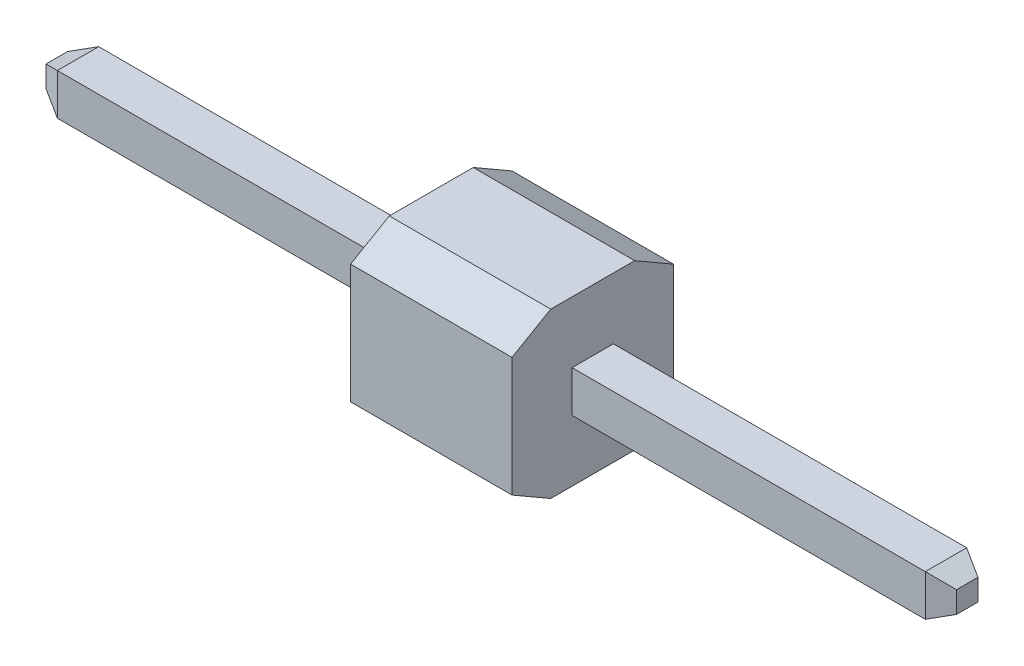
ISO-10303-21;
HEADER;
FILE_DESCRIPTION(('STEP AP214'),'2;1');
FILE_NAME('part.step','',(''),(''),'','','');
FILE_SCHEMA(('AUTOMOTIVE_DESIGN { 1 0 10303 214 1 1 1 1 }'));
ENDSEC;
DATA;
#1=APPLICATION_CONTEXT('core data for automotive mechanical design processes');
#2=APPLICATION_PROTOCOL_DEFINITION('international standard','automotive_design',2000,#1);
#3=PRODUCT_CONTEXT('',#1,'mechanical');
#4=PRODUCT('Part','Part','',(#3));
#5=PRODUCT_RELATED_PRODUCT_CATEGORY('part','',(#4));
#6=PRODUCT_DEFINITION_FORMATION('','',#4);
#7=PRODUCT_DEFINITION_CONTEXT('part definition',#1,'design');
#8=PRODUCT_DEFINITION('design','',#6,#7);
#9=PRODUCT_DEFINITION_SHAPE('','',#8);
#10=(LENGTH_UNIT() NAMED_UNIT(*) SI_UNIT(.MILLI.,.METRE.));
#11=(NAMED_UNIT(*) PLANE_ANGLE_UNIT() SI_UNIT($,.RADIAN.));
#12=(NAMED_UNIT(*) SI_UNIT($,.STERADIAN.) SOLID_ANGLE_UNIT());
#13=UNCERTAINTY_MEASURE_WITH_UNIT(LENGTH_MEASURE(1.E-05),#10,'distance_accuracy_value','');
#14=(GEOMETRIC_REPRESENTATION_CONTEXT(3) GLOBAL_UNCERTAINTY_ASSIGNED_CONTEXT((#13)) GLOBAL_UNIT_ASSIGNED_CONTEXT((#10,
#11,#12)) REPRESENTATION_CONTEXT('',''));
#15=CARTESIAN_POINT('',(0.,0.,0.));
#16=DIRECTION('',(0.,0.,1.));
#17=DIRECTION('',(1.,0.,0.));
#18=AXIS2_PLACEMENT_3D('',#15,#16,#17);
#19=CARTESIAN_POINT('',(5.42107538965371,-10.4771282629139,0.629998634255617));
#20=DIRECTION('',(1.,4.37113882867379E-08,-4.37113882867379E-08));
#21=DIRECTION('',(-4.37113882867379E-08,1.,0.));
#22=AXIS2_PLACEMENT_3D('',#19,#20,#21);
#23=PLANE('',#22);
#24=DIRECTION('',(1.59994777304463E-08,0.50000000000019,0.866025403784329));
#25=VECTOR('',#24,1.);
#26=CARTESIAN_POINT('',(5.4210752666678,-9.23353842442392,-0.940001365744382));
#27=LINE('',#26,#25);
#28=CARTESIAN_POINT('',(5.4210752666678,-9.23353842442392,-0.940001365744382));
#29=VERTEX_POINT('',#28);
#30=CARTESIAN_POINT('',(5.42107527775256,-8.88712826291392,-0.340001365744383));
#31=VERTEX_POINT('',#30);
#32=EDGE_CURVE('E11',#29,#31,#27,.T.);
#33=ORIENTED_EDGE('',*,*,#32,.T.);
#34=DIRECTION('',(4.37113886966664E-08,0.,0.999999999999999));
#35=VECTOR('',#34,1.);
#36=CARTESIAN_POINT('',(5.42107527775256,-8.88712826291392,-0.340001365744383));
#37=LINE('',#36,#35);
#38=CARTESIAN_POINT('',(5.42107533457736,-8.88712826291391,0.959998634255618));
#39=VERTEX_POINT('',#38);
#40=EDGE_CURVE('E304',#31,#39,#37,.T.);
#41=ORIENTED_EDGE('',*,*,#40,.T.);
#42=DIRECTION('',(5.97108668825761E-08,-0.500000000000186,0.86602540378433));
#43=VECTOR('',#42,1.);
#44=CARTESIAN_POINT('',(5.42107533457736,-8.88712826291391,0.959998634255618));
#45=LINE('',#44,#43);
#46=CARTESIAN_POINT('',(5.42107537594627,-9.23353842442391,1.55999863425562));
#47=VERTEX_POINT('',#46);
#48=EDGE_CURVE('E296',#39,#47,#45,.T.);
#49=ORIENTED_EDGE('',*,*,#48,.T.);
#50=DIRECTION('',(4.37113884815545E-08,-0.999999999999999,0.));
#51=VECTOR('',#50,1.);
#52=CARTESIAN_POINT('',(5.42107537594627,-9.23353842442391,1.55999863425562));
#53=LINE('',#52,#51);
#54=CARTESIAN_POINT('',(5.42107545668905,-11.0807181013939,1.55999863425562));
#55=VERTEX_POINT('',#54);
#56=EDGE_CURVE('E281',#47,#55,#53,.T.);
#57=ORIENTED_EDGE('',*,*,#56,.T.);
#58=DIRECTION('',(1.59994802942811E-08,0.500000000000192,0.866025403784328));
#59=VECTOR('',#58,1.);
#60=CARTESIAN_POINT('',(5.42107544560429,-11.4271282629139,0.959998634255618));
#61=LINE('',#60,#59);
#62=CARTESIAN_POINT('',(5.42107544560429,-11.4271282629139,0.959998634255618));
#63=VERTEX_POINT('',#62);
#64=EDGE_CURVE('E265',#63,#55,#61,.T.);
#65=ORIENTED_EDGE('',*,*,#64,.F.);
#66=DIRECTION('',(4.37113880134522E-08,0.,0.999999999999999));
#67=VECTOR('',#66,1.);
#68=CARTESIAN_POINT('',(5.42107538877949,-11.4271282629139,-0.340001365744383));
#69=LINE('',#68,#67);
#70=CARTESIAN_POINT('',(5.42107538877949,-11.4271282629139,-0.340001365744383));
#71=VERTEX_POINT('',#70);
#72=EDGE_CURVE('E248',#71,#63,#69,.T.);
#73=ORIENTED_EDGE('',*,*,#72,.F.);
#74=DIRECTION('',(5.97108656001701E-08,-0.500000000000187,0.866025403784328));
#75=VECTOR('',#74,1.);
#76=CARTESIAN_POINT('',(5.42107534741058,-11.0807181013939,-0.940001365744382));
#77=LINE('',#76,#75);
#78=CARTESIAN_POINT('',(5.42107534741058,-11.0807181013939,-0.940001365744382));
#79=VERTEX_POINT('',#78);
#80=EDGE_CURVE('E242',#79,#71,#77,.T.);
#81=ORIENTED_EDGE('',*,*,#80,.F.);
#82=DIRECTION('',(4.37113884815545E-08,-0.999999999999999,0.));
#83=VECTOR('',#82,1.);
#84=CARTESIAN_POINT('',(5.4210752666678,-9.23353842442392,-0.940001365744382));
#85=LINE('',#84,#83);
#86=EDGE_CURVE('E236',#29,#79,#85,.T.);
#87=ORIENTED_EDGE('',*,*,#86,.F.);
#88=EDGE_LOOP('',(#33,#41,#49,#57,#65,#73,#81,#87));
#89=FACE_BOUND('',#88,.T.);
#90=DIRECTION('',(-4.37113872875372E-08,0.,-0.999999999999999));
#91=VECTOR('',#90,1.);
#92=CARTESIAN_POINT('',(5.42107536167842,-9.83712826291391,0.629998634255617));
#93=LINE('',#92,#91);
#94=CARTESIAN_POINT('',(5.42107536167842,-9.83712826291391,0.629998634255617));
#95=VERTEX_POINT('',#94);
#96=CARTESIAN_POINT('',(5.42107533370314,-9.83712826291391,-0.0100013657443826));
#97=VERTEX_POINT('',#96);
#98=EDGE_CURVE('E302',#95,#97,#93,.T.);
#99=ORIENTED_EDGE('',*,*,#98,.T.);
#100=DIRECTION('',(-4.37113872875371E-08,0.999999999999999,0.));
#101=VECTOR('',#100,1.);
#102=CARTESIAN_POINT('',(5.42107536167842,-10.4771282629139,-0.0100013657443826));
#103=LINE('',#102,#101);
#104=CARTESIAN_POINT('',(5.42107536167842,-10.4771282629139,-0.0100013657443826));
#105=VERTEX_POINT('',#104);
#106=EDGE_CURVE('E293',#105,#97,#103,.T.);
#107=ORIENTED_EDGE('',*,*,#106,.F.);
#108=DIRECTION('',(-4.37113900630947E-08,0.,-0.999999999999999));
#109=VECTOR('',#108,1.);
#110=CARTESIAN_POINT('',(5.42107538965371,-10.4771282629139,0.629998634255617));
#111=LINE('',#110,#109);
#112=CARTESIAN_POINT('',(5.42107538965371,-10.4771282629139,0.629998634255617));
#113=VERTEX_POINT('',#112);
#114=EDGE_CURVE('E278',#113,#105,#111,.T.);
#115=ORIENTED_EDGE('',*,*,#114,.F.);
#116=DIRECTION('',(-4.37113900630947E-08,0.999999999999999,0.));
#117=VECTOR('',#116,1.);
#118=CARTESIAN_POINT('',(5.42107538965371,-10.4771282629139,0.629998634255617));
#119=LINE('',#118,#117);
#120=EDGE_CURVE('E263',#113,#95,#119,.T.);
#121=ORIENTED_EDGE('',*,*,#120,.T.);
#122=EDGE_LOOP('',(#99,#107,#115,#121));
#123=FACE_BOUND('',#122,.T.);
#124=ADVANCED_FACE('F17',(#89,#123),#23,.T.);
#125=CARTESIAN_POINT('',(2.92107538965371,-10.4771283721924,0.629998743534088));
#126=DIRECTION('',(1.,4.37113882867379E-08,-4.37113882867379E-08));
#127=DIRECTION('',(-4.37113882867379E-08,1.,0.));
#128=AXIS2_PLACEMENT_3D('',#125,#126,#127);
#129=PLANE('',#128);
#130=DIRECTION('',(1.59994783714339E-08,0.50000000000019,0.866025403784329));
#131=VECTOR('',#130,1.);
#132=CARTESIAN_POINT('',(2.9210752666678,-9.23353853370239,-0.940001256465912));
#133=LINE('',#132,#131);
#134=CARTESIAN_POINT('',(2.9210752666678,-9.23353853370239,-0.940001256465912));
#135=VERTEX_POINT('',#134);
#136=CARTESIAN_POINT('',(2.92107527775256,-8.88712837219239,-0.340001256465912));
#137=VERTEX_POINT('',#136);
#138=EDGE_CURVE('E24',#135,#137,#133,.T.);
#139=ORIENTED_EDGE('',*,*,#138,.F.);
#140=DIRECTION('',(4.37113882411397E-08,-0.999999999999999,0.));
#141=VECTOR('',#140,1.);
#142=CARTESIAN_POINT('',(2.9210752666678,-9.23353853370239,-0.940001256465912));
#143=LINE('',#142,#141);
#144=CARTESIAN_POINT('',(2.92107534741058,-11.0807182106724,-0.940001256465912));
#145=VERTEX_POINT('',#144);
#146=EDGE_CURVE('E300',#135,#145,#143,.T.);
#147=ORIENTED_EDGE('',*,*,#146,.T.);
#148=DIRECTION('',(5.97108668821452E-08,-0.500000000000187,0.866025403784328));
#149=VECTOR('',#148,1.);
#150=CARTESIAN_POINT('',(2.92107534741058,-11.0807182106724,-0.940001256465912));
#151=LINE('',#150,#149);
#152=CARTESIAN_POINT('',(2.92107538877949,-11.4271283721924,-0.340001256465912));
#153=VERTEX_POINT('',#152);
#154=EDGE_CURVE('E286',#145,#153,#151,.T.);
#155=ORIENTED_EDGE('',*,*,#154,.T.);
#156=DIRECTION('',(4.37113880134522E-08,0.,0.999999999999999));
#157=VECTOR('',#156,1.);
#158=CARTESIAN_POINT('',(2.92107538877949,-11.4271283721924,-0.340001256465912));
#159=LINE('',#158,#157);
#160=CARTESIAN_POINT('',(2.92107544560429,-11.4271283721924,0.959998743534088));
#161=VERTEX_POINT('',#160);
#162=EDGE_CURVE('E271',#153,#161,#159,.T.);
#163=ORIENTED_EDGE('',*,*,#162,.T.);
#164=DIRECTION('',(1.5999479012306E-08,0.500000000000192,0.866025403784328));
#165=VECTOR('',#164,1.);
#166=CARTESIAN_POINT('',(2.92107544560429,-11.4271283721924,0.959998743534088));
#167=LINE('',#166,#165);
#168=CARTESIAN_POINT('',(2.92107545668905,-11.0807182106724,1.55999874353409));
#169=VERTEX_POINT('',#168);
#170=EDGE_CURVE('E253',#161,#169,#167,.T.);
#171=ORIENTED_EDGE('',*,*,#170,.T.);
#172=DIRECTION('',(4.37113882411397E-08,-0.999999999999999,0.));
#173=VECTOR('',#172,1.);
#174=CARTESIAN_POINT('',(2.92107537594627,-9.23353853370238,1.55999874353409));
#175=LINE('',#174,#173);
#176=CARTESIAN_POINT('',(2.92107537594627,-9.23353853370238,1.55999874353409));
#177=VERTEX_POINT('',#176);
#178=EDGE_CURVE('E261',#177,#169,#175,.T.);
#179=ORIENTED_EDGE('',*,*,#178,.F.);
#180=DIRECTION('',(5.97108668825761E-08,-0.500000000000186,0.86602540378433));
#181=VECTOR('',#180,1.);
#182=CARTESIAN_POINT('',(2.92107533457736,-8.88712837219238,0.959998743534088));
#183=LINE('',#182,#181);
#184=CARTESIAN_POINT('',(2.92107533457736,-8.88712837219238,0.959998743534088));
#185=VERTEX_POINT('',#184);
#186=EDGE_CURVE('E276',#185,#177,#183,.T.);
#187=ORIENTED_EDGE('',*,*,#186,.F.);
#188=DIRECTION('',(4.37113883550593E-08,0.,0.999999999999999));
#189=VECTOR('',#188,1.);
#190=CARTESIAN_POINT('',(2.92107527775256,-8.88712837219239,-0.340001256465912));
#191=LINE('',#190,#189);
#192=EDGE_CURVE('E291',#137,#185,#191,.T.);
#193=ORIENTED_EDGE('',*,*,#192,.F.);
#194=EDGE_LOOP('',(#139,#147,#155,#163,#171,#179,#187,#193));
#195=FACE_BOUND('',#194,.T.);
#196=DIRECTION('',(-4.37113879814265E-08,0.999999999999999,0.));
#197=VECTOR('',#196,1.);
#198=CARTESIAN_POINT('',(2.92107536167842,-10.4771283721924,-0.0100012564659119));
#199=LINE('',#198,#197);
#200=CARTESIAN_POINT('',(2.92107536167842,-10.4771283721924,-0.0100012564659119));
#201=VERTEX_POINT('',#200);
#202=CARTESIAN_POINT('',(2.92107533370314,-9.83712837219238,-0.0100012564659119));
#203=VERTEX_POINT('',#202);
#204=EDGE_CURVE('E298',#201,#203,#199,.T.);
#205=ORIENTED_EDGE('',*,*,#204,.T.);
#206=DIRECTION('',(-4.37113879814266E-08,0.,-0.999999999999999));
#207=VECTOR('',#206,1.);
#208=CARTESIAN_POINT('',(2.92107536167842,-9.83712837219238,0.629998743534088));
#209=LINE('',#208,#207);
#210=CARTESIAN_POINT('',(2.92107536167842,-9.83712837219238,0.629998743534088));
#211=VERTEX_POINT('',#210);
#212=EDGE_CURVE('E283',#211,#203,#209,.T.);
#213=ORIENTED_EDGE('',*,*,#212,.F.);
#214=DIRECTION('',(-4.37113886753159E-08,0.999999999999999,0.));
#215=VECTOR('',#214,1.);
#216=CARTESIAN_POINT('',(2.92107538965371,-10.4771283721924,0.629998743534088));
#217=LINE('',#216,#215);
#218=CARTESIAN_POINT('',(2.92107538965371,-10.4771283721924,0.629998743534088));
#219=VERTEX_POINT('',#218);
#220=EDGE_CURVE('E268',#219,#211,#217,.T.);
#221=ORIENTED_EDGE('',*,*,#220,.F.);
#222=DIRECTION('',(-4.37113886753159E-08,0.,-0.999999999999999));
#223=VECTOR('',#222,1.);
#224=CARTESIAN_POINT('',(2.92107538965371,-10.4771283721924,0.629998743534088));
#225=LINE('',#224,#223);
#226=EDGE_CURVE('E251',#219,#201,#225,.T.);
#227=ORIENTED_EDGE('',*,*,#226,.T.);
#228=EDGE_LOOP('',(#205,#213,#221,#227));
#229=FACE_BOUND('',#228,.T.);
#230=ADVANCED_FACE('F314',(#195,#229),#129,.F.);
#231=CARTESIAN_POINT('',(5.4210752666678,-9.23353842442392,-0.940001365744382));
#232=DIRECTION('',(5.97108668343731E-08,-0.866025403784328,0.50000000000019));
#233=DIRECTION('',(-1.59994785476185E-08,-0.500000000000192,-0.866025403784329));
#234=AXIS2_PLACEMENT_3D('',#231,#232,#233);
#235=PLANE('',#234);
#236=ORIENTED_EDGE('',*,*,#138,.T.);
#237=DIRECTION('',(-0.999999999999998,-4.37113868656524E-08,4.37113883755557E-08));
#238=VECTOR('',#237,1.);
#239=CARTESIAN_POINT('',(5.42107527775256,-8.88712826291392,-0.340001365744383));
#240=LINE('',#239,#238);
#241=EDGE_CURVE('E288',#31,#137,#240,.T.);
#242=ORIENTED_EDGE('',*,*,#241,.F.);
#243=ORIENTED_EDGE('',*,*,#32,.F.);
#244=DIRECTION('',(-0.999999999999998,-4.37113897078233E-08,4.37113881091022E-08));
#245=VECTOR('',#244,1.);
#246=CARTESIAN_POINT('',(5.4210752666678,-9.23353842442392,-0.940001365744382));
#247=LINE('',#246,#245);
#248=EDGE_CURVE('E256',#29,#135,#247,.T.);
#249=ORIENTED_EDGE('',*,*,#248,.T.);
#250=EDGE_LOOP('',(#236,#242,#243,#249));
#251=FACE_BOUND('',#250,.T.);
#252=ADVANCED_FACE('F306',(#251),#235,.F.);
#253=CARTESIAN_POINT('',(5.42107527775256,-8.88712826291392,-0.340001365744383));
#254=DIRECTION('',(4.37113882867379E-08,-1.,0.));
#255=DIRECTION('',(1.,4.37113882867379E-08,-4.37113882867379E-08));
#256=AXIS2_PLACEMENT_3D('',#253,#254,#255);
#257=PLANE('',#256);
#258=ORIENTED_EDGE('',*,*,#192,.T.);
#259=DIRECTION('',(-0.999999999999998,-4.37113868656524E-08,4.37113882867378E-08));
#260=VECTOR('',#259,1.);
#261=CARTESIAN_POINT('',(5.42107533457736,-8.88712826291391,0.959998634255618));
#262=LINE('',#261,#260);
#263=EDGE_CURVE('E273',#39,#185,#262,.T.);
#264=ORIENTED_EDGE('',*,*,#263,.F.);
#265=ORIENTED_EDGE('',*,*,#40,.F.);
#266=ORIENTED_EDGE('',*,*,#241,.T.);
#267=EDGE_LOOP('',(#258,#264,#265,#266));
#268=FACE_BOUND('',#267,.T.);
#269=ADVANCED_FACE('F311',(#268),#257,.F.);
#270=CARTESIAN_POINT('',(5.42107533457736,-8.88712826291391,0.959998634255618));
#271=DIRECTION('',(1.59994785476185E-08,-0.86602540378433,-0.50000000000019));
#272=DIRECTION('',(-5.97108668343731E-08,0.500000000000188,-0.866025403784329));
#273=AXIS2_PLACEMENT_3D('',#270,#271,#272);
#274=PLANE('',#273);
#275=ORIENTED_EDGE('',*,*,#186,.T.);
#276=DIRECTION('',(-0.999999999999998,-4.37113897078233E-08,4.37113882867378E-08));
#277=VECTOR('',#276,1.);
#278=CARTESIAN_POINT('',(5.42107537594627,-9.23353842442391,1.55999863425562));
#279=LINE('',#278,#277);
#280=EDGE_CURVE('E258',#47,#177,#279,.T.);
#281=ORIENTED_EDGE('',*,*,#280,.F.);
#282=ORIENTED_EDGE('',*,*,#48,.F.);
#283=ORIENTED_EDGE('',*,*,#263,.T.);
#284=EDGE_LOOP('',(#275,#281,#282,#283));
#285=FACE_BOUND('',#284,.T.);
#286=ADVANCED_FACE('F319',(#285),#274,.F.);
#287=CARTESIAN_POINT('',(5.42107537594627,-9.23353842442391,1.55999863425562));
#288=DIRECTION('',(-4.37113882867379E-08,0.,-1.));
#289=DIRECTION('',(-1.,-4.37113882867379E-08,4.37113882867379E-08));
#290=AXIS2_PLACEMENT_3D('',#287,#288,#289);
#291=PLANE('',#290);
#292=ORIENTED_EDGE('',*,*,#178,.T.);
#293=DIRECTION('',(-0.999999999999998,-4.37113897078233E-08,4.37113882867378E-08));
#294=VECTOR('',#293,1.);
#295=CARTESIAN_POINT('',(5.42107545668905,-11.0807181013939,1.55999863425562));
#296=LINE('',#295,#294);
#297=EDGE_CURVE('E245',#55,#169,#296,.T.);
#298=ORIENTED_EDGE('',*,*,#297,.F.);
#299=ORIENTED_EDGE('',*,*,#56,.F.);
#300=ORIENTED_EDGE('',*,*,#280,.T.);
#301=EDGE_LOOP('',(#292,#298,#299,#300));
#302=FACE_BOUND('',#301,.T.);
#303=ADVANCED_FACE('F326',(#302),#291,.F.);
#304=CARTESIAN_POINT('',(5.42107544560429,-11.4271282629139,0.959998634255618));
#305=DIRECTION('',(5.97108668343731E-08,-0.866025403784328,0.50000000000019));
#306=DIRECTION('',(-1.59994785476185E-08,-0.500000000000192,-0.866025403784329));
#307=AXIS2_PLACEMENT_3D('',#304,#305,#306);
#308=PLANE('',#307);
#309=ORIENTED_EDGE('',*,*,#170,.F.);
#310=DIRECTION('',(-0.999999999999998,-4.37113897078233E-08,4.37113882867378E-08));
#311=VECTOR('',#310,1.);
#312=CARTESIAN_POINT('',(5.42107544560429,-11.4271282629139,0.959998634255618));
#313=LINE('',#312,#311);
#314=EDGE_CURVE('E239',#63,#161,#313,.T.);
#315=ORIENTED_EDGE('',*,*,#314,.F.);
#316=ORIENTED_EDGE('',*,*,#64,.T.);
#317=ORIENTED_EDGE('',*,*,#297,.T.);
#318=EDGE_LOOP('',(#309,#315,#316,#317));
#319=FACE_BOUND('',#318,.T.);
#320=ADVANCED_FACE('F329',(#319),#308,.T.);
#321=CARTESIAN_POINT('',(5.42107538877949,-11.4271282629139,-0.340001365744383));
#322=DIRECTION('',(4.37113882867379E-08,-1.,0.));
#323=DIRECTION('',(1.,4.37113882867379E-08,-4.37113882867379E-08));
#324=AXIS2_PLACEMENT_3D('',#321,#322,#323);
#325=PLANE('',#324);
#326=ORIENTED_EDGE('',*,*,#162,.F.);
#327=DIRECTION('',(-0.999999999999998,-4.37113897078233E-08,4.37113883755557E-08));
#328=VECTOR('',#327,1.);
#329=CARTESIAN_POINT('',(5.42107538877949,-11.4271282629139,-0.340001365744383));
#330=LINE('',#329,#328);
#331=EDGE_CURVE('E233',#71,#153,#330,.T.);
#332=ORIENTED_EDGE('',*,*,#331,.F.);
#333=ORIENTED_EDGE('',*,*,#72,.T.);
#334=ORIENTED_EDGE('',*,*,#314,.T.);
#335=EDGE_LOOP('',(#326,#332,#333,#334));
#336=FACE_BOUND('',#335,.T.);
#337=ADVANCED_FACE('F333',(#336),#325,.T.);
#338=CARTESIAN_POINT('',(5.42107534741058,-11.0807181013939,-0.940001365744382));
#339=DIRECTION('',(1.59994785476185E-08,-0.86602540378433,-0.50000000000019));
#340=DIRECTION('',(-5.97108668343731E-08,0.500000000000188,-0.866025403784329));
#341=AXIS2_PLACEMENT_3D('',#338,#339,#340);
#342=PLANE('',#341);
#343=ORIENTED_EDGE('',*,*,#154,.F.);
#344=DIRECTION('',(-0.999999999999998,-4.37113897078233E-08,4.37113881091021E-08));
#345=VECTOR('',#344,1.);
#346=CARTESIAN_POINT('',(5.42107534741058,-11.0807181013939,-0.940001365744382));
#347=LINE('',#346,#345);
#348=EDGE_CURVE('E230',#79,#145,#347,.T.);
#349=ORIENTED_EDGE('',*,*,#348,.F.);
#350=ORIENTED_EDGE('',*,*,#80,.T.);
#351=ORIENTED_EDGE('',*,*,#331,.T.);
#352=EDGE_LOOP('',(#343,#349,#350,#351));
#353=FACE_BOUND('',#352,.T.);
#354=ADVANCED_FACE('F337',(#353),#342,.T.);
#355=CARTESIAN_POINT('',(5.4210752666678,-9.23353842442392,-0.940001365744382));
#356=DIRECTION('',(-4.37113882867379E-08,0.,-1.));
#357=DIRECTION('',(-4.37113882867379E-08,1.,0.));
#358=AXIS2_PLACEMENT_3D('',#355,#356,#357);
#359=PLANE('',#358);
#360=ORIENTED_EDGE('',*,*,#146,.F.);
#361=ORIENTED_EDGE('',*,*,#248,.F.);
#362=ORIENTED_EDGE('',*,*,#86,.T.);
#363=ORIENTED_EDGE('',*,*,#348,.T.);
#364=EDGE_LOOP('',(#360,#361,#362,#363));
#365=FACE_BOUND('',#364,.T.);
#366=ADVANCED_FACE('F339',(#365),#359,.T.);
#367=CARTESIAN_POINT('',(-2.87892461034629,-10.4771286257184,0.62999899706014));
#368=DIRECTION('',(-1.,-4.37113882867379E-08,4.37113882867379E-08));
#369=DIRECTION('',(4.37113882867379E-08,-1.,0.));
#370=AXIS2_PLACEMENT_3D('',#367,#368,#369);
#371=PLANE('',#370);
#372=DIRECTION('',(4.37113927490808E-08,-0.999999999999999,0.));
#373=VECTOR('',#372,1.);
#374=CARTESIAN_POINT('',(-2.87892465284411,-9.99101015290844,0.14388052425114));
#375=LINE('',#374,#373);
#376=CARTESIAN_POINT('',(-2.87892465284411,-9.99101015290844,0.14388052425114));
#377=VERTEX_POINT('',#376);
#378=CARTESIAN_POINT('',(-2.87892463832158,-10.3232470985184,0.14388052425114));
#379=VERTEX_POINT('',#378);
#380=EDGE_CURVE('E228',#377,#379,#375,.T.);
#381=ORIENTED_EDGE('',*,*,#380,.T.);
#382=DIRECTION('',(4.37113874013716E-08,0.,0.999999999999999));
#383=VECTOR('',#382,1.);
#384=CARTESIAN_POINT('',(-2.87892463832158,-10.3232470985184,0.14388052425114));
#385=LINE('',#384,#383);
#386=CARTESIAN_POINT('',(-2.87892462379904,-10.3232470985184,0.47611746986914));
#387=VERTEX_POINT('',#386);
#388=EDGE_CURVE('E223',#379,#387,#385,.T.);
#389=ORIENTED_EDGE('',*,*,#388,.T.);
#390=DIRECTION('',(-4.37113900757526E-08,0.999999999999999,0.));
#391=VECTOR('',#390,1.);
#392=CARTESIAN_POINT('',(-2.87892462379904,-10.3232470985184,0.47611746986914));
#393=LINE('',#392,#391);
#394=CARTESIAN_POINT('',(-2.87892463832158,-9.99101015290844,0.47611746986914));
#395=VERTEX_POINT('',#394);
#396=EDGE_CURVE('E215',#387,#395,#393,.T.);
#397=ORIENTED_EDGE('',*,*,#396,.T.);
#398=DIRECTION('',(-4.37113847280434E-08,0.,-0.999999999999999));
#399=VECTOR('',#398,1.);
#400=CARTESIAN_POINT('',(-2.87892463832158,-9.99101015290844,0.47611746986914));
#401=LINE('',#400,#399);
#402=EDGE_CURVE('E207',#395,#377,#401,.T.);
#403=ORIENTED_EDGE('',*,*,#402,.T.);
#404=EDGE_LOOP('',(#381,#389,#397,#403));
#405=FACE_BOUND('',#404,.T.);
#406=ADVANCED_FACE('F341',(#405),#371,.T.);
#407=CARTESIAN_POINT('',(-2.87892461034629,-10.4771286257184,0.62999899706014));
#408=DIRECTION('',(4.37113882867379E-08,-1.,0.));
#409=DIRECTION('',(-4.37113882867379E-08,0.,-1.));
#410=AXIS2_PLACEMENT_3D('',#407,#408,#409);
#411=PLANE('',#410);
#412=DIRECTION('',(0.999999999999998,4.37113881958092E-08,-4.37113882769955E-08));
#413=VECTOR('',#412,1.);
#414=CARTESIAN_POINT('',(-2.54892461034629,-10.4771286112937,0.629998982635382));
#415=LINE('',#414,#413);
#416=CARTESIAN_POINT('',(-2.54892461034629,-10.4771286112937,0.629998982635382));
#417=VERTEX_POINT('',#416);
#418=EDGE_CURVE('E225',#417,#219,#415,.T.);
#419=ORIENTED_EDGE('',*,*,#418,.F.);
#420=DIRECTION('',(-4.37113872875372E-08,0.,-0.999999999999999));
#421=VECTOR('',#420,1.);
#422=CARTESIAN_POINT('',(-2.54892461034629,-10.4771286112937,0.629998982635382));
#423=LINE('',#422,#421);
#424=CARTESIAN_POINT('',(-2.54892463832157,-10.4771286112937,-0.010001017364618));
#425=VERTEX_POINT('',#424);
#426=EDGE_CURVE('E217',#417,#425,#423,.T.);
#427=ORIENTED_EDGE('',*,*,#426,.T.);
#428=DIRECTION('',(0.999999999999998,4.37113881958092E-08,-4.37113882161058E-08));
#429=VECTOR('',#428,1.);
#430=CARTESIAN_POINT('',(-2.54892463832157,-10.4771286112937,-0.010001017364618));
#431=LINE('',#430,#429);
#432=EDGE_CURVE('E220',#425,#201,#431,.T.);
#433=ORIENTED_EDGE('',*,*,#432,.T.);
#434=ORIENTED_EDGE('',*,*,#226,.F.);
#435=EDGE_LOOP('',(#419,#427,#433,#434));
#436=FACE_BOUND('',#435,.T.);
#437=ADVANCED_FACE('F348',(#436),#411,.T.);
#438=CARTESIAN_POINT('',(-2.87892463832158,-10.4771286257184,-0.0100010029398598));
#439=DIRECTION('',(-4.37113882867379E-08,0.,-1.));
#440=DIRECTION('',(-1.,-4.37113882867379E-08,4.37113882867379E-08));
#441=AXIS2_PLACEMENT_3D('',#438,#439,#440);
#442=PLANE('',#441);
#443=ORIENTED_EDGE('',*,*,#432,.F.);
#444=DIRECTION('',(-4.37113886753159E-08,0.999999999999999,0.));
#445=VECTOR('',#444,1.);
#446=CARTESIAN_POINT('',(-2.54892463832157,-10.4771286112937,-0.010001017364618));
#447=LINE('',#446,#445);
#448=CARTESIAN_POINT('',(-2.54892466629686,-9.83712861129368,-0.010001017364618));
#449=VERTEX_POINT('',#448);
#450=EDGE_CURVE('E209',#425,#449,#447,.T.);
#451=ORIENTED_EDGE('',*,*,#450,.T.);
#452=DIRECTION('',(0.999999999999998,4.37113907937716E-08,-4.37113882161057E-08));
#453=VECTOR('',#452,1.);
#454=CARTESIAN_POINT('',(-2.54892466629686,-9.83712861129368,-0.010001017364618));
#455=LINE('',#454,#453);
#456=EDGE_CURVE('E212',#449,#203,#455,.T.);
#457=ORIENTED_EDGE('',*,*,#456,.T.);
#458=ORIENTED_EDGE('',*,*,#204,.F.);
#459=EDGE_LOOP('',(#443,#451,#457,#458));
#460=FACE_BOUND('',#459,.T.);
#461=ADVANCED_FACE('F424',(#460),#442,.T.);
#462=CARTESIAN_POINT('',(-2.87892463832158,-9.83712862571844,0.62999899706014));
#463=DIRECTION('',(4.37113882867379E-08,-1.,0.));
#464=DIRECTION('',(-4.37113882867379E-08,0.,-1.));
#465=AXIS2_PLACEMENT_3D('',#462,#463,#464);
#466=PLANE('',#465);
#467=ORIENTED_EDGE('',*,*,#456,.F.);
#468=DIRECTION('',(4.37113900630947E-08,0.,0.999999999999999));
#469=VECTOR('',#468,1.);
#470=CARTESIAN_POINT('',(-2.54892466629686,-9.83712861129368,-0.010001017364618));
#471=LINE('',#470,#469);
#472=CARTESIAN_POINT('',(-2.54892463832157,-9.83712861129368,0.629998982635382));
#473=VERTEX_POINT('',#472);
#474=EDGE_CURVE('E201',#449,#473,#471,.T.);
#475=ORIENTED_EDGE('',*,*,#474,.T.);
#476=DIRECTION('',(0.999999999999998,4.37113907937716E-08,-4.37113882769955E-08));
#477=VECTOR('',#476,1.);
#478=CARTESIAN_POINT('',(-2.54892463832157,-9.83712861129368,0.629998982635382));
#479=LINE('',#478,#477);
#480=EDGE_CURVE('E204',#473,#211,#479,.T.);
#481=ORIENTED_EDGE('',*,*,#480,.T.);
#482=ORIENTED_EDGE('',*,*,#212,.T.);
#483=EDGE_LOOP('',(#467,#475,#481,#482));
#484=FACE_BOUND('',#483,.T.);
#485=ADVANCED_FACE('F421',(#484),#466,.F.);
#486=CARTESIAN_POINT('',(-2.87892461034629,-10.4771286257184,0.62999899706014));
#487=DIRECTION('',(-4.37113882867379E-08,0.,-1.));
#488=DIRECTION('',(-1.,-4.37113882867379E-08,4.37113882867379E-08));
#489=AXIS2_PLACEMENT_3D('',#486,#487,#488);
#490=PLANE('',#489);
#491=ORIENTED_EDGE('',*,*,#480,.F.);
#492=DIRECTION('',(4.37113858997586E-08,-0.999999999999999,0.));
#493=VECTOR('',#492,1.);
#494=CARTESIAN_POINT('',(-2.54892463832157,-9.83712861129368,0.629998982635382));
#495=LINE('',#494,#493);
#496=EDGE_CURVE('E196',#473,#417,#495,.T.);
#497=ORIENTED_EDGE('',*,*,#496,.T.);
#498=ORIENTED_EDGE('',*,*,#418,.T.);
#499=ORIENTED_EDGE('',*,*,#220,.T.);
#500=EDGE_LOOP('',(#491,#497,#498,#499));
#501=FACE_BOUND('',#500,.T.);
#502=ADVANCED_FACE('F376',(#501),#490,.F.);
#503=CARTESIAN_POINT('',(-2.87892461034629,-10.4771286257184,0.62999899706014));
#504=DIRECTION('',(-4.37113882867379E-08,0.,-1.));
#505=DIRECTION('',(-1.,-4.37113882867379E-08,4.37113882867379E-08));
#506=AXIS2_PLACEMENT_3D('',#503,#504,#505);
#507=PLANE('',#506);
#508=DIRECTION('',(0.999999999999998,4.37113829998842E-08,-4.37113882769955E-08));
#509=VECTOR('',#508,1.);
#510=CARTESIAN_POINT('',(5.42107538965371,-10.4771282629139,0.629998634255617));
#511=LINE('',#510,#509);
#512=CARTESIAN_POINT('',(10.8910753896537,-10.4771280238126,0.629998395154324));
#513=VERTEX_POINT('',#512);
#514=EDGE_CURVE('E199',#113,#513,#511,.T.);
#515=ORIENTED_EDGE('',*,*,#514,.T.);
#516=DIRECTION('',(-4.37113872875371E-08,0.999999999999999,0.));
#517=VECTOR('',#516,1.);
#518=CARTESIAN_POINT('',(10.8910753896537,-10.4771280238126,0.629998395154324));
#519=LINE('',#518,#517);
#520=CARTESIAN_POINT('',(10.8910753616784,-9.83712802381262,0.629998395154324));
#521=VERTEX_POINT('',#520);
#522=EDGE_CURVE('E191',#513,#521,#519,.T.);
#523=ORIENTED_EDGE('',*,*,#522,.T.);
#524=DIRECTION('',(0.999999999999998,4.37113933917341E-08,-4.37113882769955E-08));
#525=VECTOR('',#524,1.);
#526=CARTESIAN_POINT('',(5.42107536167842,-9.83712826291391,0.629998634255617));
#527=LINE('',#526,#525);
#528=EDGE_CURVE('E194',#95,#521,#527,.T.);
#529=ORIENTED_EDGE('',*,*,#528,.F.);
#530=ORIENTED_EDGE('',*,*,#120,.F.);
#531=EDGE_LOOP('',(#515,#523,#529,#530));
#532=FACE_BOUND('',#531,.T.);
#533=ADVANCED_FACE('F367',(#532),#507,.F.);
#534=CARTESIAN_POINT('',(-2.87892463832158,-9.83712862571844,0.62999899706014));
#535=DIRECTION('',(4.37113882867379E-08,-1.,0.));
#536=DIRECTION('',(-4.37113882867379E-08,0.,-1.));
#537=AXIS2_PLACEMENT_3D('',#534,#535,#536);
#538=PLANE('',#537);
#539=ORIENTED_EDGE('',*,*,#528,.T.);
#540=DIRECTION('',(-4.37113900630947E-08,0.,-0.999999999999999));
#541=VECTOR('',#540,1.);
#542=CARTESIAN_POINT('',(10.8910753616784,-9.83712802381262,0.629998395154324));
#543=LINE('',#542,#541);
#544=CARTESIAN_POINT('',(10.8910753337031,-9.83712802381262,-0.0100016048456765));
#545=VERTEX_POINT('',#544);
#546=EDGE_CURVE('E186',#521,#545,#543,.T.);
#547=ORIENTED_EDGE('',*,*,#546,.T.);
#548=DIRECTION('',(0.999999999999998,4.37113933917341E-08,-4.37113881146228E-08));
#549=VECTOR('',#548,1.);
#550=CARTESIAN_POINT('',(5.42107533370314,-9.83712826291391,-0.0100013657443823));
#551=LINE('',#550,#549);
#552=EDGE_CURVE('E189',#97,#545,#551,.T.);
#553=ORIENTED_EDGE('',*,*,#552,.F.);
#554=ORIENTED_EDGE('',*,*,#98,.F.);
#555=EDGE_LOOP('',(#539,#547,#553,#554));
#556=FACE_BOUND('',#555,.T.);
#557=ADVANCED_FACE('F364',(#556),#538,.F.);
#558=CARTESIAN_POINT('',(-2.87892463832158,-10.4771286257184,-0.0100010029398598));
#559=DIRECTION('',(-4.37113882867379E-08,0.,-1.));
#560=DIRECTION('',(-1.,-4.37113882867379E-08,4.37113882867379E-08));
#561=AXIS2_PLACEMENT_3D('',#558,#559,#560);
#562=PLANE('',#561);
#563=ORIENTED_EDGE('',*,*,#552,.T.);
#564=DIRECTION('',(4.37113900630949E-08,-0.999999999999999,0.));
#565=VECTOR('',#564,1.);
#566=CARTESIAN_POINT('',(10.8910753337031,-9.83712802381262,-0.0100016048456764));
#567=LINE('',#566,#565);
#568=CARTESIAN_POINT('',(10.8910753616784,-10.4771280238126,-0.0100016048456765));
#569=VERTEX_POINT('',#568);
#570=EDGE_CURVE('E176',#545,#569,#567,.T.);
#571=ORIENTED_EDGE('',*,*,#570,.T.);
#572=DIRECTION('',(0.999999999999998,4.37113829998842E-08,-4.37113881146228E-08));
#573=VECTOR('',#572,1.);
#574=CARTESIAN_POINT('',(5.42107536167842,-10.4771282629139,-0.0100013657443823));
#575=LINE('',#574,#573);
#576=EDGE_CURVE('E179',#105,#569,#575,.T.);
#577=ORIENTED_EDGE('',*,*,#576,.F.);
#578=ORIENTED_EDGE('',*,*,#106,.T.);
#579=EDGE_LOOP('',(#563,#571,#577,#578));
#580=FACE_BOUND('',#579,.T.);
#581=ADVANCED_FACE('F366',(#580),#562,.T.);
#582=CARTESIAN_POINT('',(-2.87892461034629,-10.4771286257184,0.62999899706014));
#583=DIRECTION('',(4.37113882867379E-08,-1.,0.));
#584=DIRECTION('',(-4.37113882867379E-08,0.,-1.));
#585=AXIS2_PLACEMENT_3D('',#582,#583,#584);
#586=PLANE('',#585);
#587=ORIENTED_EDGE('',*,*,#576,.T.);
#588=DIRECTION('',(4.37113872875372E-08,0.,0.999999999999999));
#589=VECTOR('',#588,1.);
#590=CARTESIAN_POINT('',(10.8910753616784,-10.4771280238126,-0.0100016048456765));
#591=LINE('',#590,#589);
#592=EDGE_CURVE('E167',#569,#513,#591,.T.);
#593=ORIENTED_EDGE('',*,*,#592,.T.);
#594=ORIENTED_EDGE('',*,*,#514,.F.);
#595=ORIENTED_EDGE('',*,*,#114,.T.);
#596=EDGE_LOOP('',(#587,#593,#594,#595));
#597=FACE_BOUND('',#596,.T.);
#598=ADVANCED_FACE('F373',(#597),#586,.T.);
#599=CARTESIAN_POINT('',(11.2210753896537,-10.4771280093879,0.629998380729565));
#600=DIRECTION('',(-1.,-4.37113882867379E-08,4.37113882867379E-08));
#601=DIRECTION('',(4.37113882867379E-08,-1.,0.));
#602=AXIS2_PLACEMENT_3D('',#599,#600,#601);
#603=PLANE('',#602);
#604=DIRECTION('',(-4.37113874024243E-08,0.999999999999999,0.));
#605=VECTOR('',#604,1.);
#606=CARTESIAN_POINT('',(11.2210753616784,-10.3232464821879,0.143879907920565));
#607=LINE('',#606,#605);
#608=CARTESIAN_POINT('',(11.2210753616784,-10.3232464821879,0.143879907920565));
#609=VERTEX_POINT('',#608);
#610=CARTESIAN_POINT('',(11.2210753471559,-9.99100953657786,0.143879907920565));
#611=VERTEX_POINT('',#610);
#612=EDGE_CURVE('E153',#609,#611,#607,.T.);
#613=ORIENTED_EDGE('',*,*,#612,.T.);
#614=DIRECTION('',(4.37113874013716E-08,0.,0.999999999999999));
#615=VECTOR('',#614,1.);
#616=CARTESIAN_POINT('',(11.2210753471559,-9.99100953657787,0.143879907920565));
#617=LINE('',#616,#615);
#618=CARTESIAN_POINT('',(11.2210753616784,-9.99100953657786,0.476116853538565));
#619=VERTEX_POINT('',#618);
#620=EDGE_CURVE('E395',#611,#619,#617,.T.);
#621=ORIENTED_EDGE('',*,*,#620,.T.);
#622=DIRECTION('',(4.37113874024243E-08,-0.999999999999999,0.));
#623=VECTOR('',#622,1.);
#624=CARTESIAN_POINT('',(11.2210753616784,-9.99100953657786,0.476116853538565));
#625=LINE('',#624,#623);
#626=CARTESIAN_POINT('',(11.221075376201,-10.3232464821879,0.476116853538565));
#627=VERTEX_POINT('',#626);
#628=EDGE_CURVE('E156',#619,#627,#625,.T.);
#629=ORIENTED_EDGE('',*,*,#628,.T.);
#630=DIRECTION('',(-4.37113927480282E-08,0.,-0.999999999999999));
#631=VECTOR('',#630,1.);
#632=CARTESIAN_POINT('',(11.221075376201,-10.3232464821879,0.476116853538565));
#633=LINE('',#632,#631);
#634=EDGE_CURVE('E149',#627,#609,#633,.T.);
#635=ORIENTED_EDGE('',*,*,#634,.T.);
#636=EDGE_LOOP('',(#613,#621,#629,#635));
#637=FACE_BOUND('',#636,.T.);
#638=ADVANCED_FACE('F151',(#637),#603,.F.);
#639=CARTESIAN_POINT('',(-2.8789246315952,-9.99101015290844,0.62999899706014));
#640=DIRECTION('',(-0.422618301356784,0.906307768563367,1.84732310895534E-08));
#641=DIRECTION('',(4.37113882867379E-08,0.,1.));
#642=AXIS2_PLACEMENT_3D('',#639,#640,#641);
#643=PLANE('',#642);
#644=DIRECTION('',(0.834817095446925,0.38928165712602,-0.389281657126018));
#645=VECTOR('',#644,1.);
#646=CARTESIAN_POINT('',(-2.87892465284413,-9.99101015290792,0.143880524251623));
#647=LINE('',#646,#645);
#648=EDGE_CURVE('E181',#377,#449,#647,.T.);
#649=ORIENTED_EDGE('',*,*,#648,.F.);
#650=ORIENTED_EDGE('',*,*,#402,.F.);
#651=DIRECTION('',(-0.834817129479007,-0.389281657126019,-0.389281584143986));
#652=VECTOR('',#651,1.);
#653=CARTESIAN_POINT('',(-2.548924638322,-9.83712861129221,0.629998982634844));
#654=LINE('',#653,#652);
#655=EDGE_CURVE('E404',#473,#395,#654,.T.);
#656=ORIENTED_EDGE('',*,*,#655,.F.);
#657=ORIENTED_EDGE('',*,*,#474,.F.);
#658=EDGE_LOOP('',(#649,#650,#656,#657));
#659=FACE_BOUND('',#658,.T.);
#660=ADVANCED_FACE('F418',(#659),#643,.T.);
#661=CARTESIAN_POINT('',(-2.87892461707266,-10.4771286257184,0.47611746986914));
#662=DIRECTION('',(-0.422618222124841,-1.84732292043498E-08,0.906307805509828));
#663=DIRECTION('',(4.37113882867379E-08,-1.,0.));
#664=AXIS2_PLACEMENT_3D('',#661,#662,#663);
#665=PLANE('',#664);
#666=ORIENTED_EDGE('',*,*,#655,.T.);
#667=ORIENTED_EDGE('',*,*,#396,.F.);
#668=DIRECTION('',(-0.834817163511087,0.389281584143985,-0.389281584143987));
#669=VECTOR('',#668,1.);
#670=CARTESIAN_POINT('',(-2.54892461034514,-10.4771286112909,0.629998982635654));
#671=LINE('',#670,#669);
#672=EDGE_CURVE('E160',#417,#387,#671,.T.);
#673=ORIENTED_EDGE('',*,*,#672,.F.);
#674=ORIENTED_EDGE('',*,*,#496,.F.);
#675=EDGE_LOOP('',(#666,#667,#673,#674));
#676=FACE_BOUND('',#675,.T.);
#677=ADVANCED_FACE('F434',(#676),#665,.T.);
#678=CARTESIAN_POINT('',(-2.54892463832157,-10.4771286112937,-0.010001017364618));
#679=DIRECTION('',(0.422618301356784,1.8473232667688E-08,0.906307768563367));
#680=DIRECTION('',(-4.37113882867379E-08,1.,0.));
#681=AXIS2_PLACEMENT_3D('',#678,#679,#680);
#682=PLANE('',#681);
#683=ORIENTED_EDGE('',*,*,#648,.T.);
#684=ORIENTED_EDGE('',*,*,#450,.F.);
#685=DIRECTION('',(0.834817129479008,-0.389281584143985,-0.389281657126018));
#686=VECTOR('',#685,1.);
#687=CARTESIAN_POINT('',(-2.87892463832441,-10.323247098526,0.1438805242526));
#688=LINE('',#687,#686);
#689=EDGE_CURVE('E170',#379,#425,#688,.T.);
#690=ORIENTED_EDGE('',*,*,#689,.F.);
#691=ORIENTED_EDGE('',*,*,#380,.F.);
#692=EDGE_LOOP('',(#683,#684,#690,#691));
#693=FACE_BOUND('',#692,.T.);
#694=ADVANCED_FACE('F413',(#693),#682,.F.);
#695=CARTESIAN_POINT('',(-2.54892461034629,-10.4771286112937,0.629998982635382));
#696=DIRECTION('',(0.422618222124841,0.906307805509828,-1.84732308250282E-08));
#697=DIRECTION('',(-4.37113882867379E-08,0.,-1.));
#698=AXIS2_PLACEMENT_3D('',#695,#696,#697);
#699=PLANE('',#698);
#700=ORIENTED_EDGE('',*,*,#672,.T.);
#701=ORIENTED_EDGE('',*,*,#388,.F.);
#702=ORIENTED_EDGE('',*,*,#689,.T.);
#703=ORIENTED_EDGE('',*,*,#426,.F.);
#704=EDGE_LOOP('',(#700,#701,#702,#703));
#705=FACE_BOUND('',#704,.T.);
#706=ADVANCED_FACE('F429',(#705),#699,.F.);
#707=CARTESIAN_POINT('',(11.2210753829273,-10.3232464821879,0.629998380729565));
#708=DIRECTION('',(0.422618301356784,-0.906307768563367,-1.84732310470096E-08));
#709=DIRECTION('',(4.37113882867379E-08,0.,1.));
#710=AXIS2_PLACEMENT_3D('',#707,#708,#709);
#711=PLANE('',#710);
#712=DIRECTION('',(-0.834817129479003,-0.389281657126027,-0.389281584143988));
#713=VECTOR('',#712,1.);
#714=CARTESIAN_POINT('',(11.2210753616784,-10.3232464821884,0.143879907921048));
#715=LINE('',#714,#713);
#716=EDGE_CURVE('E164',#609,#569,#715,.T.);
#717=ORIENTED_EDGE('',*,*,#716,.F.);
#718=ORIENTED_EDGE('',*,*,#634,.F.);
#719=DIRECTION('',(0.834817095446923,0.389281657126025,-0.389281657126018));
#720=VECTOR('',#719,1.);
#721=CARTESIAN_POINT('',(10.8910753896537,-10.4771280238126,0.629998395154324));
#722=LINE('',#721,#720);
#723=EDGE_CURVE('E392',#513,#627,#722,.T.);
#724=ORIENTED_EDGE('',*,*,#723,.F.);
#725=ORIENTED_EDGE('',*,*,#592,.F.);
#726=EDGE_LOOP('',(#717,#718,#724,#725));
#727=FACE_BOUND('',#726,.T.);
#728=ADVANCED_FACE('F165',(#727),#711,.T.);
#729=CARTESIAN_POINT('',(10.8910753896537,-10.4771280238126,0.629998395154324));
#730=DIRECTION('',(-0.422618301356784,-1.8473232667688E-08,-0.906307768563367));
#731=DIRECTION('',(-4.37113882867379E-08,1.,0.));
#732=AXIS2_PLACEMENT_3D('',#729,#730,#731);
#733=PLANE('',#732);
#734=ORIENTED_EDGE('',*,*,#723,.T.);
#735=ORIENTED_EDGE('',*,*,#628,.F.);
#736=DIRECTION('',(0.834817129479006,-0.389281584143989,-0.38928165712602));
#737=VECTOR('',#736,1.);
#738=CARTESIAN_POINT('',(10.89107536168,-9.83712802380841,0.629998395153421));
#739=LINE('',#738,#737);
#740=EDGE_CURVE('E389',#521,#619,#739,.T.);
#741=ORIENTED_EDGE('',*,*,#740,.F.);
#742=ORIENTED_EDGE('',*,*,#522,.F.);
#743=EDGE_LOOP('',(#734,#735,#741,#742));
#744=FACE_BOUND('',#743,.T.);
#745=ADVANCED_FACE('F390',(#744),#733,.F.);
#746=CARTESIAN_POINT('',(11.2210753684048,-10.4771280093879,0.143879907920565));
#747=DIRECTION('',(0.422618222124841,1.84732292043498E-08,-0.906307805509828));
#748=DIRECTION('',(4.37113882867379E-08,-1.,0.));
#749=AXIS2_PLACEMENT_3D('',#746,#747,#748);
#750=PLANE('',#749);
#751=ORIENTED_EDGE('',*,*,#716,.T.);
#752=ORIENTED_EDGE('',*,*,#570,.F.);
#753=DIRECTION('',(-0.834817163511088,0.389281584143981,-0.389281584143989));
#754=VECTOR('',#753,1.);
#755=CARTESIAN_POINT('',(11.2210753471559,-9.99100953657734,0.143879907921048));
#756=LINE('',#755,#754);
#757=EDGE_CURVE('E175',#611,#545,#756,.T.);
#758=ORIENTED_EDGE('',*,*,#757,.F.);
#759=ORIENTED_EDGE('',*,*,#612,.F.);
#760=EDGE_LOOP('',(#751,#752,#758,#759));
#761=FACE_BOUND('',#760,.T.);
#762=ADVANCED_FACE('F173',(#761),#750,.T.);
#763=CARTESIAN_POINT('',(10.8910753616784,-9.83712802381262,0.629998395154324));
#764=DIRECTION('',(-0.422618222124841,-0.906307805509828,1.84732307824844E-08));
#765=DIRECTION('',(-4.37113882867379E-08,0.,-1.));
#766=AXIS2_PLACEMENT_3D('',#763,#764,#765);
#767=PLANE('',#766);
#768=ORIENTED_EDGE('',*,*,#740,.T.);
#769=ORIENTED_EDGE('',*,*,#620,.F.);
#770=ORIENTED_EDGE('',*,*,#757,.T.);
#771=ORIENTED_EDGE('',*,*,#546,.F.);
#772=EDGE_LOOP('',(#768,#769,#770,#771));
#773=FACE_BOUND('',#772,.T.);
#774=ADVANCED_FACE('F394',(#773),#767,.F.);
#775=CLOSED_SHELL('',(#124,#230,#252,#269,#286,#303,#320,#337,#354,#366,#406,#437,#461,#485,
#502,#533,#557,#581,#598,#638,#660,#677,#694,#706,#728,#745,#762,#774));
#776=MANIFOLD_SOLID_BREP('B1',#775);
#777=ADVANCED_BREP_SHAPE_REPRESENTATION('',(#18,#776),#14);
#778=SHAPE_DEFINITION_REPRESENTATION(#9,#777);
ENDSEC;
END-ISO-10303-21;
